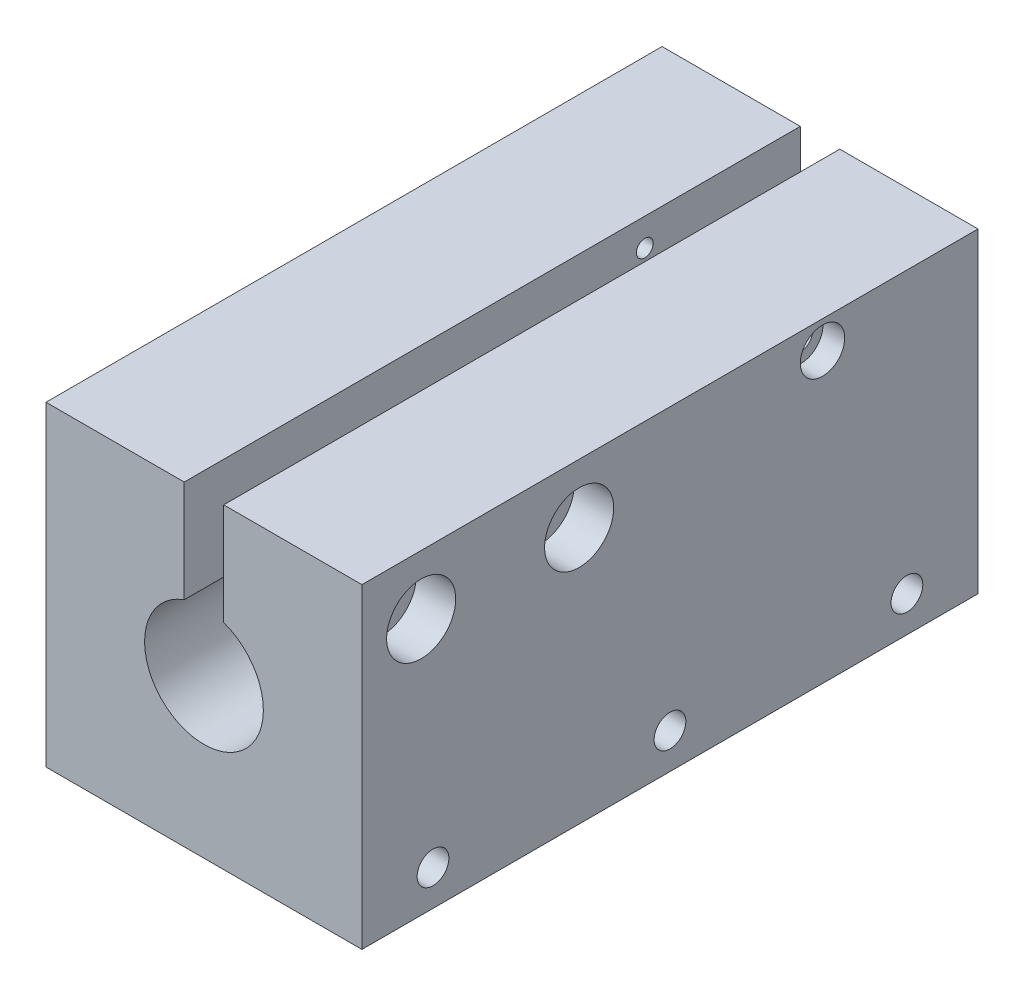
ISO-10303-21;
HEADER;
FILE_DESCRIPTION(('STEP AP214'),'2;1');
FILE_NAME('part.step','',(''),(''),'','','');
FILE_SCHEMA(('AUTOMOTIVE_DESIGN { 1 0 10303 214 1 1 1 1 }'));
ENDSEC;
DATA;
#1=APPLICATION_CONTEXT('core data for automotive mechanical design processes');
#2=APPLICATION_PROTOCOL_DEFINITION('international standard','automotive_design',2000,#1);
#3=PRODUCT_CONTEXT('',#1,'mechanical');
#4=PRODUCT('Part','Part','',(#3));
#5=PRODUCT_RELATED_PRODUCT_CATEGORY('part','',(#4));
#6=PRODUCT_DEFINITION_FORMATION('','',#4);
#7=PRODUCT_DEFINITION_CONTEXT('part definition',#1,'design');
#8=PRODUCT_DEFINITION('design','',#6,#7);
#9=PRODUCT_DEFINITION_SHAPE('','',#8);
#10=(LENGTH_UNIT() NAMED_UNIT(*) SI_UNIT(.MILLI.,.METRE.));
#11=(NAMED_UNIT(*) PLANE_ANGLE_UNIT() SI_UNIT($,.RADIAN.));
#12=(NAMED_UNIT(*) SI_UNIT($,.STERADIAN.) SOLID_ANGLE_UNIT());
#13=UNCERTAINTY_MEASURE_WITH_UNIT(LENGTH_MEASURE(1.E-05),#10,'distance_accuracy_value','');
#14=(GEOMETRIC_REPRESENTATION_CONTEXT(3) GLOBAL_UNCERTAINTY_ASSIGNED_CONTEXT((#13)) GLOBAL_UNIT_ASSIGNED_CONTEXT((#10,
#11,#12)) REPRESENTATION_CONTEXT('',''));
#15=CARTESIAN_POINT('',(0.,0.,0.));
#16=DIRECTION('',(0.,0.,1.));
#17=DIRECTION('',(1.,0.,0.));
#18=AXIS2_PLACEMENT_3D('',#15,#16,#17);
#19=CARTESIAN_POINT('',(0.,50.8,99.06));
#20=DIRECTION('',(0.,-1.,0.));
#21=DIRECTION('',(0.,0.,-1.));
#22=AXIS2_PLACEMENT_3D('',#19,#20,#21);
#23=PLANE('',#22);
#24=DIRECTION('',(-1.,0.,0.));
#25=VECTOR('',#24,1.);
#26=CARTESIAN_POINT('',(0.,50.8,0.));
#27=LINE('',#26,#25);
#28=CARTESIAN_POINT('',(50.8,50.8,0.));
#29=VERTEX_POINT('',#28);
#30=CARTESIAN_POINT('',(28.575,50.8,0.));
#31=VERTEX_POINT('',#30);
#32=EDGE_CURVE('E269',#29,#31,#27,.T.);
#33=ORIENTED_EDGE('',*,*,#32,.T.);
#34=DIRECTION('',(0.,0.,-1.));
#35=VECTOR('',#34,1.);
#36=CARTESIAN_POINT('',(28.575,50.8,99.06));
#37=LINE('',#36,#35);
#38=CARTESIAN_POINT('',(28.575,50.8,99.06));
#39=VERTEX_POINT('',#38);
#40=EDGE_CURVE('E239',#39,#31,#37,.T.);
#41=ORIENTED_EDGE('',*,*,#40,.F.);
#42=DIRECTION('',(-1.,0.,0.));
#43=VECTOR('',#42,1.);
#44=CARTESIAN_POINT('',(0.,50.8,99.06));
#45=LINE('',#44,#43);
#46=CARTESIAN_POINT('',(50.8,50.8,99.06));
#47=VERTEX_POINT('',#46);
#48=EDGE_CURVE('E274',#47,#39,#45,.T.);
#49=ORIENTED_EDGE('',*,*,#48,.F.);
#50=DIRECTION('',(0.,0.,-1.));
#51=VECTOR('',#50,1.);
#52=CARTESIAN_POINT('',(50.8,50.8,99.06));
#53=LINE('',#52,#51);
#54=EDGE_CURVE('E289',#47,#29,#53,.T.);
#55=ORIENTED_EDGE('',*,*,#54,.T.);
#56=EDGE_LOOP('',(#33,#41,#49,#55));
#57=FACE_BOUND('',#56,.T.);
#58=ADVANCED_FACE('F39',(#57),#23,.F.);
#59=CARTESIAN_POINT('',(0.,0.,99.06));
#60=DIRECTION('',(1.,0.,0.));
#61=DIRECTION('',(0.,1.,0.));
#62=AXIS2_PLACEMENT_3D('',#59,#60,#61);
#63=PLANE('',#62);
#64=CARTESIAN_POINT('',(0.,5.71499999999999,11.43));
#65=DIRECTION('',(-1.,0.,0.));
#66=DIRECTION('',(0.,0.,1.));
#67=AXIS2_PLACEMENT_3D('',#64,#65,#66);
#68=CIRCLE('',#67,2.55269999999999);
#69=CARTESIAN_POINT('',(0.,5.71499999999999,13.9827));
#70=VERTEX_POINT('',#69);
#71=EDGE_CURVE('E142',#70,#70,#68,.T.);
#72=ORIENTED_EDGE('',*,*,#71,.F.);
#73=EDGE_LOOP('',(#72));
#74=FACE_BOUND('',#73,.T.);
#75=CARTESIAN_POINT('',(0.,5.71499999999999,49.53));
#76=DIRECTION('',(-1.,0.,0.));
#77=DIRECTION('',(0.,0.,1.));
#78=AXIS2_PLACEMENT_3D('',#75,#76,#77);
#79=CIRCLE('',#78,2.55269999999999);
#80=CARTESIAN_POINT('',(0.,5.71499999999999,52.0827));
#81=VERTEX_POINT('',#80);
#82=EDGE_CURVE('E141',#81,#81,#79,.T.);
#83=ORIENTED_EDGE('',*,*,#82,.F.);
#84=EDGE_LOOP('',(#83));
#85=FACE_BOUND('',#84,.T.);
#86=CARTESIAN_POINT('',(0.,5.71499999999999,87.63));
#87=DIRECTION('',(-1.,0.,0.));
#88=DIRECTION('',(0.,0.,1.));
#89=AXIS2_PLACEMENT_3D('',#86,#87,#88);
#90=CIRCLE('',#89,2.55269999999999);
#91=CARTESIAN_POINT('',(0.,5.71499999999999,90.1827));
#92=VERTEX_POINT('',#91);
#93=EDGE_CURVE('E152',#92,#92,#90,.T.);
#94=ORIENTED_EDGE('',*,*,#93,.F.);
#95=EDGE_LOOP('',(#94));
#96=FACE_BOUND('',#95,.T.);
#97=CARTESIAN_POINT('',(0.,46.355,25.));
#98=DIRECTION('',(1.,0.,0.));
#99=DIRECTION('',(0.,0.,-1.));
#100=AXIS2_PLACEMENT_3D('',#97,#98,#99);
#101=CIRCLE('',#100,1.35254999999999);
#102=CARTESIAN_POINT('',(0.,46.355,23.64745));
#103=VERTEX_POINT('',#102);
#104=EDGE_CURVE('E179',#103,#103,#101,.T.);
#105=ORIENTED_EDGE('',*,*,#104,.T.);
#106=EDGE_LOOP('',(#105));
#107=FACE_BOUND('',#106,.T.);
#108=CARTESIAN_POINT('',(0.,41.275,89.535));
#109=DIRECTION('',(1.,0.,0.));
#110=DIRECTION('',(0.,1.,0.));
#111=AXIS2_PLACEMENT_3D('',#108,#109,#110);
#112=CIRCLE('',#111,2.55269999999999);
#113=CARTESIAN_POINT('',(0.,43.8277,89.535));
#114=VERTEX_POINT('',#113);
#115=EDGE_CURVE('E195',#114,#114,#112,.F.);
#116=ORIENTED_EDGE('',*,*,#115,.F.);
#117=EDGE_LOOP('',(#116));
#118=FACE_BOUND('',#117,.T.);
#119=CARTESIAN_POINT('',(0.,41.275,64.135));
#120=DIRECTION('',(1.,0.,0.));
#121=DIRECTION('',(0.,1.,0.));
#122=AXIS2_PLACEMENT_3D('',#119,#120,#121);
#123=CIRCLE('',#122,2.55269999999999);
#124=CARTESIAN_POINT('',(0.,43.8277,64.135));
#125=VERTEX_POINT('',#124);
#126=EDGE_CURVE('E201',#125,#125,#123,.F.);
#127=ORIENTED_EDGE('',*,*,#126,.F.);
#128=EDGE_LOOP('',(#127));
#129=FACE_BOUND('',#128,.T.);
#130=DIRECTION('',(0.,-1.,0.));
#131=VECTOR('',#130,1.);
#132=CARTESIAN_POINT('',(0.,0.,0.));
#133=LINE('',#132,#131);
#134=CARTESIAN_POINT('',(0.,50.8,0.));
#135=VERTEX_POINT('',#134);
#136=CARTESIAN_POINT('',(0.,0.,0.));
#137=VERTEX_POINT('',#136);
#138=EDGE_CURVE('E262',#135,#137,#133,.T.);
#139=ORIENTED_EDGE('',*,*,#138,.T.);
#140=DIRECTION('',(0.,0.,-1.));
#141=VECTOR('',#140,1.);
#142=CARTESIAN_POINT('',(0.,0.,99.06));
#143=LINE('',#142,#141);
#144=CARTESIAN_POINT('',(0.,0.,99.06));
#145=VERTEX_POINT('',#144);
#146=EDGE_CURVE('E295',#145,#137,#143,.T.);
#147=ORIENTED_EDGE('',*,*,#146,.F.);
#148=DIRECTION('',(0.,-1.,0.));
#149=VECTOR('',#148,1.);
#150=CARTESIAN_POINT('',(0.,0.,99.06));
#151=LINE('',#150,#149);
#152=CARTESIAN_POINT('',(0.,50.8,99.06));
#153=VERTEX_POINT('',#152);
#154=EDGE_CURVE('E265',#153,#145,#151,.T.);
#155=ORIENTED_EDGE('',*,*,#154,.F.);
#156=DIRECTION('',(0.,0.,-1.));
#157=VECTOR('',#156,1.);
#158=CARTESIAN_POINT('',(0.,50.8,99.06));
#159=LINE('',#158,#157);
#160=EDGE_CURVE('E277',#153,#135,#159,.T.);
#161=ORIENTED_EDGE('',*,*,#160,.T.);
#162=EDGE_LOOP('',(#139,#147,#155,#161));
#163=FACE_BOUND('',#162,.T.);
#164=ADVANCED_FACE('F41',(#74,#85,#96,#107,#118,#129,#163),#63,.F.);
#165=CARTESIAN_POINT('',(0.,0.,99.06));
#166=DIRECTION('',(0.,1.,0.));
#167=DIRECTION('',(0.,0.,1.));
#168=AXIS2_PLACEMENT_3D('',#165,#166,#167);
#169=PLANE('',#168);
#170=DIRECTION('',(1.,0.,0.));
#171=VECTOR('',#170,1.);
#172=CARTESIAN_POINT('',(0.,0.,0.));
#173=LINE('',#172,#171);
#174=CARTESIAN_POINT('',(50.8,0.,0.));
#175=VERTEX_POINT('',#174);
#176=EDGE_CURVE('E280',#137,#175,#173,.T.);
#177=ORIENTED_EDGE('',*,*,#176,.T.);
#178=DIRECTION('',(0.,0.,-1.));
#179=VECTOR('',#178,1.);
#180=CARTESIAN_POINT('',(50.8,0.,99.06));
#181=LINE('',#180,#179);
#182=CARTESIAN_POINT('',(50.8,0.,99.06));
#183=VERTEX_POINT('',#182);
#184=EDGE_CURVE('E292',#183,#175,#181,.T.);
#185=ORIENTED_EDGE('',*,*,#184,.F.);
#186=DIRECTION('',(1.,0.,0.));
#187=VECTOR('',#186,1.);
#188=CARTESIAN_POINT('',(0.,0.,99.06));
#189=LINE('',#188,#187);
#190=EDGE_CURVE('E268',#145,#183,#189,.T.);
#191=ORIENTED_EDGE('',*,*,#190,.F.);
#192=ORIENTED_EDGE('',*,*,#146,.T.);
#193=EDGE_LOOP('',(#177,#185,#191,#192));
#194=FACE_BOUND('',#193,.T.);
#195=ADVANCED_FACE('F334',(#194),#169,.F.);
#196=CARTESIAN_POINT('',(50.8,0.,99.06));
#197=DIRECTION('',(-1.,0.,0.));
#198=DIRECTION('',(0.,-1.,0.));
#199=AXIS2_PLACEMENT_3D('',#196,#197,#198);
#200=PLANE('',#199);
#201=CARTESIAN_POINT('',(50.8,5.715,87.63));
#202=DIRECTION('',(1.,0.,0.));
#203=DIRECTION('',(0.,0.,-1.));
#204=AXIS2_PLACEMENT_3D('',#201,#202,#203);
#205=CIRCLE('',#204,2.55269999999999);
#206=CARTESIAN_POINT('',(50.8,5.715,85.0773));
#207=VERTEX_POINT('',#206);
#208=EDGE_CURVE('E158',#207,#207,#205,.T.);
#209=ORIENTED_EDGE('',*,*,#208,.F.);
#210=EDGE_LOOP('',(#209));
#211=FACE_BOUND('',#210,.T.);
#212=CARTESIAN_POINT('',(50.8,5.715,49.53));
#213=DIRECTION('',(1.,0.,0.));
#214=DIRECTION('',(0.,0.,-1.));
#215=AXIS2_PLACEMENT_3D('',#212,#213,#214);
#216=CIRCLE('',#215,2.55269999999999);
#217=CARTESIAN_POINT('',(50.8,5.715,46.9773));
#218=VERTEX_POINT('',#217);
#219=EDGE_CURVE('E164',#218,#218,#216,.T.);
#220=ORIENTED_EDGE('',*,*,#219,.F.);
#221=EDGE_LOOP('',(#220));
#222=FACE_BOUND('',#221,.T.);
#223=CARTESIAN_POINT('',(50.8,5.715,11.43));
#224=DIRECTION('',(1.,0.,0.));
#225=DIRECTION('',(0.,0.,-1.));
#226=AXIS2_PLACEMENT_3D('',#223,#224,#225);
#227=CIRCLE('',#226,2.55269999999999);
#228=CARTESIAN_POINT('',(50.8,5.715,8.87730000000001));
#229=VERTEX_POINT('',#228);
#230=EDGE_CURVE('E170',#229,#229,#227,.T.);
#231=ORIENTED_EDGE('',*,*,#230,.F.);
#232=EDGE_LOOP('',(#231));
#233=FACE_BOUND('',#232,.T.);
#234=CARTESIAN_POINT('',(50.8,46.355,25.));
#235=DIRECTION('',(1.,0.,0.));
#236=DIRECTION('',(0.,0.,-1.));
#237=AXIS2_PLACEMENT_3D('',#234,#235,#236);
#238=CIRCLE('',#237,3.57251);
#239=CARTESIAN_POINT('',(50.8,46.355,21.42749));
#240=VERTEX_POINT('',#239);
#241=EDGE_CURVE('E182',#240,#240,#238,.T.);
#242=ORIENTED_EDGE('',*,*,#241,.F.);
#243=EDGE_LOOP('',(#242));
#244=FACE_BOUND('',#243,.T.);
#245=CARTESIAN_POINT('',(50.8,41.275,89.535));
#246=DIRECTION('',(1.,0.,0.));
#247=DIRECTION('',(0.,0.,-1.));
#248=AXIS2_PLACEMENT_3D('',#245,#246,#247);
#249=CIRCLE('',#248,5.55625);
#250=CARTESIAN_POINT('',(50.8,41.275,83.97875));
#251=VERTEX_POINT('',#250);
#252=EDGE_CURVE('E204',#251,#251,#249,.T.);
#253=ORIENTED_EDGE('',*,*,#252,.F.);
#254=EDGE_LOOP('',(#253));
#255=FACE_BOUND('',#254,.T.);
#256=CARTESIAN_POINT('',(50.8,41.275,64.135));
#257=DIRECTION('',(1.,0.,0.));
#258=DIRECTION('',(0.,0.,-1.));
#259=AXIS2_PLACEMENT_3D('',#256,#257,#258);
#260=CIRCLE('',#259,5.55625);
#261=CARTESIAN_POINT('',(50.8,41.275,58.57875));
#262=VERTEX_POINT('',#261);
#263=EDGE_CURVE('E210',#262,#262,#260,.T.);
#264=ORIENTED_EDGE('',*,*,#263,.F.);
#265=EDGE_LOOP('',(#264));
#266=FACE_BOUND('',#265,.T.);
#267=DIRECTION('',(0.,1.,0.));
#268=VECTOR('',#267,1.);
#269=CARTESIAN_POINT('',(50.8,0.,0.));
#270=LINE('',#269,#268);
#271=EDGE_CURVE('E282',#175,#29,#270,.T.);
#272=ORIENTED_EDGE('',*,*,#271,.T.);
#273=ORIENTED_EDGE('',*,*,#54,.F.);
#274=DIRECTION('',(0.,1.,0.));
#275=VECTOR('',#274,1.);
#276=CARTESIAN_POINT('',(50.8,0.,99.06));
#277=LINE('',#276,#275);
#278=EDGE_CURVE('E271',#183,#47,#277,.T.);
#279=ORIENTED_EDGE('',*,*,#278,.F.);
#280=ORIENTED_EDGE('',*,*,#184,.T.);
#281=EDGE_LOOP('',(#272,#273,#279,#280));
#282=FACE_BOUND('',#281,.T.);
#283=ADVANCED_FACE('F336',(#211,#222,#233,#244,#255,#266,#282),#200,.F.);
#284=CARTESIAN_POINT('',(22.225,50.8,99.06));
#285=VERTEX_POINT('',#284);
#286=EDGE_CURVE('E273',#285,#153,#45,.T.);
#287=ORIENTED_EDGE('',*,*,#286,.F.);
#288=DIRECTION('',(0.,0.,-1.));
#289=VECTOR('',#288,1.);
#290=CARTESIAN_POINT('',(22.225,50.8,99.06));
#291=LINE('',#290,#289);
#292=CARTESIAN_POINT('',(22.225,50.8,0.));
#293=VERTEX_POINT('',#292);
#294=EDGE_CURVE('E236',#285,#293,#291,.T.);
#295=ORIENTED_EDGE('',*,*,#294,.T.);
#296=EDGE_CURVE('E284',#293,#135,#27,.T.);
#297=ORIENTED_EDGE('',*,*,#296,.T.);
#298=ORIENTED_EDGE('',*,*,#160,.F.);
#299=EDGE_LOOP('',(#287,#295,#297,#298));
#300=FACE_BOUND('',#299,.T.);
#301=ADVANCED_FACE('F327',(#300),#23,.F.);
#302=CARTESIAN_POINT('',(0.,0.,99.06));
#303=DIRECTION('',(0.,0.,-1.));
#304=DIRECTION('',(-1.,0.,0.));
#305=AXIS2_PLACEMENT_3D('',#302,#303,#304);
#306=PLANE('',#305);
#307=ORIENTED_EDGE('',*,*,#48,.T.);
#308=DIRECTION('',(0.,-1.,0.));
#309=VECTOR('',#308,1.);
#310=CARTESIAN_POINT('',(28.575,50.8,99.06));
#311=LINE('',#310,#309);
#312=CARTESIAN_POINT('',(28.575,34.4071924127333,99.06));
#313=VERTEX_POINT('',#312);
#314=EDGE_CURVE('E231',#39,#313,#311,.T.);
#315=ORIENTED_EDGE('',*,*,#314,.T.);
#316=CARTESIAN_POINT('',(25.4,25.4,99.06));
#317=DIRECTION('',(0.,0.,-1.));
#318=DIRECTION('',(-1.,0.,0.));
#319=AXIS2_PLACEMENT_3D('',#316,#317,#318);
#320=CIRCLE('',#319,9.5504);
#321=CARTESIAN_POINT('',(22.225,34.4071924127333,99.06));
#322=VERTEX_POINT('',#321);
#323=EDGE_CURVE('E253',#313,#322,#320,.T.);
#324=ORIENTED_EDGE('',*,*,#323,.T.);
#325=DIRECTION('',(0.,1.,0.));
#326=VECTOR('',#325,1.);
#327=CARTESIAN_POINT('',(22.225,50.8,99.06));
#328=LINE('',#327,#326);
#329=EDGE_CURVE('E61',#322,#285,#328,.T.);
#330=ORIENTED_EDGE('',*,*,#329,.T.);
#331=ORIENTED_EDGE('',*,*,#286,.T.);
#332=ORIENTED_EDGE('',*,*,#154,.T.);
#333=ORIENTED_EDGE('',*,*,#190,.T.);
#334=ORIENTED_EDGE('',*,*,#278,.T.);
#335=EDGE_LOOP('',(#307,#315,#324,#330,#331,#332,#333,#334));
#336=FACE_BOUND('',#335,.T.);
#337=ADVANCED_FACE('F303',(#336),#306,.F.);
#338=CARTESIAN_POINT('',(0.,0.,0.));
#339=DIRECTION('',(0.,0.,-1.));
#340=DIRECTION('',(-1.,0.,0.));
#341=AXIS2_PLACEMENT_3D('',#338,#339,#340);
#342=PLANE('',#341);
#343=DIRECTION('',(0.,-1.,0.));
#344=VECTOR('',#343,1.);
#345=CARTESIAN_POINT('',(28.575,50.8,0.));
#346=LINE('',#345,#344);
#347=CARTESIAN_POINT('',(28.575,41.8463331779458,0.));
#348=VERTEX_POINT('',#347);
#349=EDGE_CURVE('E222',#31,#348,#346,.T.);
#350=ORIENTED_EDGE('',*,*,#349,.F.);
#351=ORIENTED_EDGE('',*,*,#32,.F.);
#352=ORIENTED_EDGE('',*,*,#271,.F.);
#353=ORIENTED_EDGE('',*,*,#176,.F.);
#354=ORIENTED_EDGE('',*,*,#138,.F.);
#355=ORIENTED_EDGE('',*,*,#296,.F.);
#356=DIRECTION('',(0.,1.,0.));
#357=VECTOR('',#356,1.);
#358=CARTESIAN_POINT('',(22.225,50.8,0.));
#359=LINE('',#358,#357);
#360=CARTESIAN_POINT('',(22.225,41.8463331779458,0.));
#361=VERTEX_POINT('',#360);
#362=EDGE_CURVE('E234',#361,#293,#359,.T.);
#363=ORIENTED_EDGE('',*,*,#362,.F.);
#364=CARTESIAN_POINT('',(25.4,25.4,0.));
#365=DIRECTION('',(0.,0.,-1.));
#366=DIRECTION('',(-1.,0.,0.));
#367=AXIS2_PLACEMENT_3D('',#364,#365,#366);
#368=CIRCLE('',#367,16.75);
#369=EDGE_CURVE('E256',#348,#361,#368,.T.);
#370=ORIENTED_EDGE('',*,*,#369,.F.);
#371=EDGE_LOOP('',(#350,#351,#352,#353,#354,#355,#363,#370));
#372=FACE_BOUND('',#371,.T.);
#373=ADVANCED_FACE('F314',(#372),#342,.T.);
#374=CARTESIAN_POINT('',(25.4,25.4,43.18));
#375=DIRECTION('',(0.,0.,-1.));
#376=DIRECTION('',(-1.,0.,0.));
#377=AXIS2_PLACEMENT_3D('',#374,#375,#376);
#378=CYLINDRICAL_SURFACE('',#377,16.75);
#379=CARTESIAN_POINT('',(25.4,25.4,43.18));
#380=DIRECTION('',(0.,0.,-1.));
#381=DIRECTION('',(-1.,0.,0.));
#382=AXIS2_PLACEMENT_3D('',#379,#380,#381);
#383=CIRCLE('',#382,16.75);
#384=CARTESIAN_POINT('',(28.575,41.8463331779458,43.18));
#385=VERTEX_POINT('',#384);
#386=CARTESIAN_POINT('',(22.225,41.8463331779458,43.18));
#387=VERTEX_POINT('',#386);
#388=EDGE_CURVE('E259',#385,#387,#383,.T.);
#389=ORIENTED_EDGE('',*,*,#388,.F.);
#390=DIRECTION('',(0.,0.,-1.));
#391=VECTOR('',#390,1.);
#392=CARTESIAN_POINT('',(28.575,41.8463331779458,43.18));
#393=LINE('',#392,#391);
#394=EDGE_CURVE('E249',#385,#348,#393,.T.);
#395=ORIENTED_EDGE('',*,*,#394,.T.);
#396=ORIENTED_EDGE('',*,*,#369,.T.);
#397=DIRECTION('',(0.,0.,-1.));
#398=VECTOR('',#397,1.);
#399=CARTESIAN_POINT('',(22.225,41.8463331779458,43.18));
#400=LINE('',#399,#398);
#401=EDGE_CURVE('E245',#361,#387,#400,.F.);
#402=ORIENTED_EDGE('',*,*,#401,.T.);
#403=EDGE_LOOP('',(#389,#395,#396,#402));
#404=FACE_BOUND('',#403,.T.);
#405=ADVANCED_FACE('F319',(#404),#378,.F.);
#406=CARTESIAN_POINT('',(25.4,25.4,43.18));
#407=DIRECTION('',(0.,0.,-1.));
#408=DIRECTION('',(-1.,0.,0.));
#409=AXIS2_PLACEMENT_3D('',#406,#407,#408);
#410=PLANE('',#409);
#411=DIRECTION('',(0.,-1.,0.));
#412=VECTOR('',#411,1.);
#413=CARTESIAN_POINT('',(28.575,25.4,43.18));
#414=LINE('',#413,#412);
#415=CARTESIAN_POINT('',(28.575,34.4071924127333,43.18));
#416=VERTEX_POINT('',#415);
#417=EDGE_CURVE('E54',#385,#416,#414,.T.);
#418=ORIENTED_EDGE('',*,*,#417,.F.);
#419=ORIENTED_EDGE('',*,*,#388,.T.);
#420=DIRECTION('',(0.,1.,0.));
#421=VECTOR('',#420,1.);
#422=CARTESIAN_POINT('',(22.225,25.4,43.18));
#423=LINE('',#422,#421);
#424=CARTESIAN_POINT('',(22.225,34.4071924127333,43.18));
#425=VERTEX_POINT('',#424);
#426=EDGE_CURVE('E241',#425,#387,#423,.T.);
#427=ORIENTED_EDGE('',*,*,#426,.F.);
#428=CARTESIAN_POINT('',(25.4,25.4,43.18));
#429=DIRECTION('',(0.,0.,-1.));
#430=DIRECTION('',(-1.,0.,0.));
#431=AXIS2_PLACEMENT_3D('',#428,#429,#430);
#432=CIRCLE('',#431,9.5504);
#433=EDGE_CURVE('E252',#416,#425,#432,.T.);
#434=ORIENTED_EDGE('',*,*,#433,.F.);
#435=EDGE_LOOP('',(#418,#419,#427,#434));
#436=FACE_BOUND('',#435,.T.);
#437=ADVANCED_FACE('F321',(#436),#410,.T.);
#438=CARTESIAN_POINT('',(25.4,25.4,99.06));
#439=DIRECTION('',(0.,0.,-1.));
#440=DIRECTION('',(-1.,0.,0.));
#441=AXIS2_PLACEMENT_3D('',#438,#439,#440);
#442=CYLINDRICAL_SURFACE('',#441,9.5504);
#443=ORIENTED_EDGE('',*,*,#323,.F.);
#444=DIRECTION('',(0.,0.,-1.));
#445=VECTOR('',#444,1.);
#446=CARTESIAN_POINT('',(28.575,34.4071924127333,99.06));
#447=LINE('',#446,#445);
#448=EDGE_CURVE('E11',#313,#416,#447,.T.);
#449=ORIENTED_EDGE('',*,*,#448,.T.);
#450=ORIENTED_EDGE('',*,*,#433,.T.);
#451=DIRECTION('',(0.,0.,-1.));
#452=VECTOR('',#451,1.);
#453=CARTESIAN_POINT('',(22.225,34.4071924127333,99.06));
#454=LINE('',#453,#452);
#455=EDGE_CURVE('E47',#425,#322,#454,.F.);
#456=ORIENTED_EDGE('',*,*,#455,.T.);
#457=EDGE_LOOP('',(#443,#449,#450,#456));
#458=FACE_BOUND('',#457,.T.);
#459=ADVANCED_FACE('F299',(#458),#442,.F.);
#460=CARTESIAN_POINT('',(22.225,50.8,99.06));
#461=DIRECTION('',(-1.,0.,0.));
#462=DIRECTION('',(0.,-1.,0.));
#463=AXIS2_PLACEMENT_3D('',#460,#461,#462);
#464=PLANE('',#463);
#465=CARTESIAN_POINT('',(22.225,46.355,25.));
#466=DIRECTION('',(1.,0.,0.));
#467=DIRECTION('',(0.,0.,-1.));
#468=AXIS2_PLACEMENT_3D('',#465,#466,#467);
#469=CIRCLE('',#468,1.35254999999999);
#470=CARTESIAN_POINT('',(22.225,46.355,23.64745));
#471=VERTEX_POINT('',#470);
#472=EDGE_CURVE('E176',#471,#471,#469,.T.);
#473=ORIENTED_EDGE('',*,*,#472,.F.);
#474=EDGE_LOOP('',(#473));
#475=FACE_BOUND('',#474,.T.);
#476=CARTESIAN_POINT('',(22.225,41.275,89.535));
#477=DIRECTION('',(1.,0.,0.));
#478=DIRECTION('',(0.,0.,-1.));
#479=AXIS2_PLACEMENT_3D('',#476,#477,#478);
#480=CIRCLE('',#479,2.55269999999999);
#481=CARTESIAN_POINT('',(22.225,41.275,86.9823));
#482=VERTEX_POINT('',#481);
#483=EDGE_CURVE('E186',#482,#482,#480,.T.);
#484=ORIENTED_EDGE('',*,*,#483,.F.);
#485=EDGE_LOOP('',(#484));
#486=FACE_BOUND('',#485,.T.);
#487=CARTESIAN_POINT('',(22.225,41.275,64.135));
#488=DIRECTION('',(1.,0.,0.));
#489=DIRECTION('',(0.,0.,-1.));
#490=AXIS2_PLACEMENT_3D('',#487,#488,#489);
#491=CIRCLE('',#490,2.55269999999999);
#492=CARTESIAN_POINT('',(22.225,41.275,61.5823));
#493=VERTEX_POINT('',#492);
#494=EDGE_CURVE('E198',#493,#493,#491,.T.);
#495=ORIENTED_EDGE('',*,*,#494,.F.);
#496=EDGE_LOOP('',(#495));
#497=FACE_BOUND('',#496,.T.);
#498=ORIENTED_EDGE('',*,*,#362,.T.);
#499=ORIENTED_EDGE('',*,*,#294,.F.);
#500=ORIENTED_EDGE('',*,*,#329,.F.);
#501=ORIENTED_EDGE('',*,*,#455,.F.);
#502=ORIENTED_EDGE('',*,*,#426,.T.);
#503=ORIENTED_EDGE('',*,*,#401,.F.);
#504=EDGE_LOOP('',(#498,#499,#500,#501,#502,#503));
#505=FACE_BOUND('',#504,.T.);
#506=ADVANCED_FACE('F322',(#475,#486,#497,#505),#464,.F.);
#507=CARTESIAN_POINT('',(28.575,50.8,99.06));
#508=DIRECTION('',(1.,0.,0.));
#509=DIRECTION('',(0.,0.,-1.));
#510=AXIS2_PLACEMENT_3D('',#507,#508,#509);
#511=PLANE('',#510);
#512=CARTESIAN_POINT('',(28.575,46.355,25.));
#513=DIRECTION('',(1.,0.,0.));
#514=DIRECTION('',(0.,0.,-1.));
#515=AXIS2_PLACEMENT_3D('',#512,#513,#514);
#516=CIRCLE('',#515,1.89864999999999);
#517=CARTESIAN_POINT('',(28.575,46.355,23.10135));
#518=VERTEX_POINT('',#517);
#519=EDGE_CURVE('E183',#518,#518,#516,.F.);
#520=ORIENTED_EDGE('',*,*,#519,.F.);
#521=EDGE_LOOP('',(#520));
#522=FACE_BOUND('',#521,.T.);
#523=CARTESIAN_POINT('',(28.575,41.275,89.535));
#524=DIRECTION('',(1.,0.,0.));
#525=DIRECTION('',(0.,0.,-1.));
#526=AXIS2_PLACEMENT_3D('',#523,#524,#525);
#527=CIRCLE('',#526,3.3782);
#528=CARTESIAN_POINT('',(28.575,41.275,86.1568));
#529=VERTEX_POINT('',#528);
#530=EDGE_CURVE('E207',#529,#529,#527,.F.);
#531=ORIENTED_EDGE('',*,*,#530,.F.);
#532=EDGE_LOOP('',(#531));
#533=FACE_BOUND('',#532,.T.);
#534=CARTESIAN_POINT('',(28.575,41.275,64.135));
#535=DIRECTION('',(1.,0.,0.));
#536=DIRECTION('',(0.,0.,-1.));
#537=AXIS2_PLACEMENT_3D('',#534,#535,#536);
#538=CIRCLE('',#537,3.3782);
#539=CARTESIAN_POINT('',(28.575,41.275,60.7568));
#540=VERTEX_POINT('',#539);
#541=EDGE_CURVE('E219',#540,#540,#538,.F.);
#542=ORIENTED_EDGE('',*,*,#541,.F.);
#543=EDGE_LOOP('',(#542));
#544=FACE_BOUND('',#543,.T.);
#545=ORIENTED_EDGE('',*,*,#417,.T.);
#546=ORIENTED_EDGE('',*,*,#448,.F.);
#547=ORIENTED_EDGE('',*,*,#314,.F.);
#548=ORIENTED_EDGE('',*,*,#40,.T.);
#549=ORIENTED_EDGE('',*,*,#349,.T.);
#550=ORIENTED_EDGE('',*,*,#394,.F.);
#551=EDGE_LOOP('',(#545,#546,#547,#548,#549,#550));
#552=FACE_BOUND('',#551,.T.);
#553=ADVANCED_FACE('F307',(#522,#533,#544,#552),#511,.F.);
#554=CARTESIAN_POINT('',(50.8,41.275,64.135));
#555=DIRECTION('',(1.,0.,0.));
#556=DIRECTION('',(0.,0.,-1.));
#557=AXIS2_PLACEMENT_3D('',#554,#555,#556);
#558=CYLINDRICAL_SURFACE('',#557,3.3782);
#559=ORIENTED_EDGE('',*,*,#541,.T.);
#560=EDGE_LOOP('',(#559));
#561=FACE_BOUND('',#560,.T.);
#562=CARTESIAN_POINT('',(44.45,41.275,64.135));
#563=DIRECTION('',(1.,0.,0.));
#564=DIRECTION('',(0.,0.,-1.));
#565=AXIS2_PLACEMENT_3D('',#562,#563,#564);
#566=CIRCLE('',#565,3.3782);
#567=CARTESIAN_POINT('',(44.45,41.275,60.7568));
#568=VERTEX_POINT('',#567);
#569=EDGE_CURVE('E223',#568,#568,#566,.T.);
#570=ORIENTED_EDGE('',*,*,#569,.T.);
#571=EDGE_LOOP('',(#570));
#572=FACE_BOUND('',#571,.T.);
#573=ADVANCED_FACE('F365',(#561,#572),#558,.F.);
#574=CARTESIAN_POINT('',(44.45,44.6532,64.135));
#575=DIRECTION('',(-1.,0.,0.));
#576=DIRECTION('',(0.,0.,1.));
#577=AXIS2_PLACEMENT_3D('',#574,#575,#576);
#578=PLANE('',#577);
#579=ORIENTED_EDGE('',*,*,#569,.F.);
#580=EDGE_LOOP('',(#579));
#581=FACE_BOUND('',#580,.T.);
#582=CARTESIAN_POINT('',(44.45,41.275,64.135));
#583=DIRECTION('',(1.,0.,0.));
#584=DIRECTION('',(0.,0.,-1.));
#585=AXIS2_PLACEMENT_3D('',#582,#583,#584);
#586=CIRCLE('',#585,5.55625);
#587=CARTESIAN_POINT('',(44.45,41.275,58.57875));
#588=VERTEX_POINT('',#587);
#589=EDGE_CURVE('E226',#588,#588,#586,.T.);
#590=ORIENTED_EDGE('',*,*,#589,.T.);
#591=EDGE_LOOP('',(#590));
#592=FACE_BOUND('',#591,.T.);
#593=ADVANCED_FACE('F372',(#581,#592),#578,.F.);
#594=CARTESIAN_POINT('',(50.8,41.275,64.135));
#595=DIRECTION('',(1.,0.,0.));
#596=DIRECTION('',(0.,0.,-1.));
#597=AXIS2_PLACEMENT_3D('',#594,#595,#596);
#598=CYLINDRICAL_SURFACE('',#597,5.55625);
#599=ORIENTED_EDGE('',*,*,#589,.F.);
#600=EDGE_LOOP('',(#599));
#601=FACE_BOUND('',#600,.T.);
#602=ORIENTED_EDGE('',*,*,#263,.T.);
#603=EDGE_LOOP('',(#602));
#604=FACE_BOUND('',#603,.T.);
#605=ADVANCED_FACE('F376',(#601,#604),#598,.F.);
#606=CARTESIAN_POINT('',(50.8,41.275,89.535));
#607=DIRECTION('',(1.,0.,0.));
#608=DIRECTION('',(0.,0.,-1.));
#609=AXIS2_PLACEMENT_3D('',#606,#607,#608);
#610=CYLINDRICAL_SURFACE('',#609,3.3782);
#611=ORIENTED_EDGE('',*,*,#530,.T.);
#612=EDGE_LOOP('',(#611));
#613=FACE_BOUND('',#612,.T.);
#614=CARTESIAN_POINT('',(44.45,41.275,89.535));
#615=DIRECTION('',(1.,0.,0.));
#616=DIRECTION('',(0.,0.,-1.));
#617=AXIS2_PLACEMENT_3D('',#614,#615,#616);
#618=CIRCLE('',#617,3.3782);
#619=CARTESIAN_POINT('',(44.45,41.275,86.1568));
#620=VERTEX_POINT('',#619);
#621=EDGE_CURVE('E211',#620,#620,#618,.T.);
#622=ORIENTED_EDGE('',*,*,#621,.T.);
#623=EDGE_LOOP('',(#622));
#624=FACE_BOUND('',#623,.T.);
#625=ADVANCED_FACE('F380',(#613,#624),#610,.F.);
#626=CARTESIAN_POINT('',(44.45,44.6532,89.535));
#627=DIRECTION('',(-1.,0.,0.));
#628=DIRECTION('',(0.,0.,1.));
#629=AXIS2_PLACEMENT_3D('',#626,#627,#628);
#630=PLANE('',#629);
#631=ORIENTED_EDGE('',*,*,#621,.F.);
#632=EDGE_LOOP('',(#631));
#633=FACE_BOUND('',#632,.T.);
#634=CARTESIAN_POINT('',(44.45,41.275,89.535));
#635=DIRECTION('',(1.,0.,0.));
#636=DIRECTION('',(0.,0.,-1.));
#637=AXIS2_PLACEMENT_3D('',#634,#635,#636);
#638=CIRCLE('',#637,5.55625);
#639=CARTESIAN_POINT('',(44.45,41.275,83.97875));
#640=VERTEX_POINT('',#639);
#641=EDGE_CURVE('E214',#640,#640,#638,.T.);
#642=ORIENTED_EDGE('',*,*,#641,.T.);
#643=EDGE_LOOP('',(#642));
#644=FACE_BOUND('',#643,.T.);
#645=ADVANCED_FACE('F384',(#633,#644),#630,.F.);
#646=CARTESIAN_POINT('',(50.8,41.275,89.535));
#647=DIRECTION('',(1.,0.,0.));
#648=DIRECTION('',(0.,0.,-1.));
#649=AXIS2_PLACEMENT_3D('',#646,#647,#648);
#650=CYLINDRICAL_SURFACE('',#649,5.55625);
#651=ORIENTED_EDGE('',*,*,#641,.F.);
#652=EDGE_LOOP('',(#651));
#653=FACE_BOUND('',#652,.T.);
#654=ORIENTED_EDGE('',*,*,#252,.T.);
#655=EDGE_LOOP('',(#654));
#656=FACE_BOUND('',#655,.T.);
#657=ADVANCED_FACE('F388',(#653,#656),#650,.F.);
#658=CARTESIAN_POINT('',(22.225,41.275,64.135));
#659=DIRECTION('',(1.,0.,0.));
#660=DIRECTION('',(0.,0.,-1.));
#661=AXIS2_PLACEMENT_3D('',#658,#659,#660);
#662=CYLINDRICAL_SURFACE('',#661,2.55269999999999);
#663=ORIENTED_EDGE('',*,*,#126,.T.);
#664=EDGE_LOOP('',(#663));
#665=FACE_BOUND('',#664,.T.);
#666=ORIENTED_EDGE('',*,*,#494,.T.);
#667=EDGE_LOOP('',(#666));
#668=FACE_BOUND('',#667,.T.);
#669=ADVANCED_FACE('F392',(#665,#668),#662,.F.);
#670=CARTESIAN_POINT('',(22.225,41.275,89.535));
#671=DIRECTION('',(1.,0.,0.));
#672=DIRECTION('',(0.,0.,-1.));
#673=AXIS2_PLACEMENT_3D('',#670,#671,#672);
#674=CYLINDRICAL_SURFACE('',#673,2.55269999999999);
#675=ORIENTED_EDGE('',*,*,#115,.T.);
#676=EDGE_LOOP('',(#675));
#677=FACE_BOUND('',#676,.T.);
#678=ORIENTED_EDGE('',*,*,#483,.T.);
#679=EDGE_LOOP('',(#678));
#680=FACE_BOUND('',#679,.T.);
#681=ADVANCED_FACE('F396',(#677,#680),#674,.F.);
#682=CARTESIAN_POINT('',(50.8,46.355,25.));
#683=DIRECTION('',(1.,0.,0.));
#684=DIRECTION('',(0.,0.,-1.));
#685=AXIS2_PLACEMENT_3D('',#682,#683,#684);
#686=CYLINDRICAL_SURFACE('',#685,1.89864999999999);
#687=ORIENTED_EDGE('',*,*,#519,.T.);
#688=EDGE_LOOP('',(#687));
#689=FACE_BOUND('',#688,.T.);
#690=CARTESIAN_POINT('',(47.2948,46.355,25.));
#691=DIRECTION('',(1.,0.,0.));
#692=DIRECTION('',(0.,0.,-1.));
#693=AXIS2_PLACEMENT_3D('',#690,#691,#692);
#694=CIRCLE('',#693,1.89864999999999);
#695=CARTESIAN_POINT('',(47.2948,46.355,23.10135));
#696=VERTEX_POINT('',#695);
#697=EDGE_CURVE('E187',#696,#696,#694,.T.);
#698=ORIENTED_EDGE('',*,*,#697,.T.);
#699=EDGE_LOOP('',(#698));
#700=FACE_BOUND('',#699,.T.);
#701=ADVANCED_FACE('F400',(#689,#700),#686,.F.);
#702=CARTESIAN_POINT('',(47.2948,48.25365,25.));
#703=DIRECTION('',(-1.,0.,0.));
#704=DIRECTION('',(0.,0.,1.));
#705=AXIS2_PLACEMENT_3D('',#702,#703,#704);
#706=PLANE('',#705);
#707=ORIENTED_EDGE('',*,*,#697,.F.);
#708=EDGE_LOOP('',(#707));
#709=FACE_BOUND('',#708,.T.);
#710=CARTESIAN_POINT('',(47.2948,46.355,25.));
#711=DIRECTION('',(1.,0.,0.));
#712=DIRECTION('',(0.,0.,-1.));
#713=AXIS2_PLACEMENT_3D('',#710,#711,#712);
#714=CIRCLE('',#713,3.57251);
#715=CARTESIAN_POINT('',(47.2948,46.355,21.42749));
#716=VERTEX_POINT('',#715);
#717=EDGE_CURVE('E190',#716,#716,#714,.T.);
#718=ORIENTED_EDGE('',*,*,#717,.T.);
#719=EDGE_LOOP('',(#718));
#720=FACE_BOUND('',#719,.T.);
#721=ADVANCED_FACE('F404',(#709,#720),#706,.F.);
#722=CARTESIAN_POINT('',(50.8,46.355,25.));
#723=DIRECTION('',(1.,0.,0.));
#724=DIRECTION('',(0.,0.,-1.));
#725=AXIS2_PLACEMENT_3D('',#722,#723,#724);
#726=CYLINDRICAL_SURFACE('',#725,3.57251);
#727=ORIENTED_EDGE('',*,*,#717,.F.);
#728=EDGE_LOOP('',(#727));
#729=FACE_BOUND('',#728,.T.);
#730=ORIENTED_EDGE('',*,*,#241,.T.);
#731=EDGE_LOOP('',(#730));
#732=FACE_BOUND('',#731,.T.);
#733=ADVANCED_FACE('F408',(#729,#732),#726,.F.);
#734=CARTESIAN_POINT('',(22.225,46.355,25.));
#735=DIRECTION('',(1.,0.,0.));
#736=DIRECTION('',(0.,0.,-1.));
#737=AXIS2_PLACEMENT_3D('',#734,#735,#736);
#738=CYLINDRICAL_SURFACE('',#737,1.35254999999999);
#739=ORIENTED_EDGE('',*,*,#104,.F.);
#740=EDGE_LOOP('',(#739));
#741=FACE_BOUND('',#740,.T.);
#742=ORIENTED_EDGE('',*,*,#472,.T.);
#743=EDGE_LOOP('',(#742));
#744=FACE_BOUND('',#743,.T.);
#745=ADVANCED_FACE('F412',(#741,#744),#738,.F.);
#746=CARTESIAN_POINT('',(34.29,5.715,11.43));
#747=DIRECTION('',(1.,0.,0.));
#748=DIRECTION('',(0.,0.,-1.));
#749=AXIS2_PLACEMENT_3D('',#746,#747,#748);
#750=CONICAL_SURFACE('',#749,2.5527,1.02974425867665);
#751=CARTESIAN_POINT('',(32.7561830978083,5.715,11.43));
#752=VERTEX_POINT('',#751);
#753=VERTEX_LOOP('',#752);
#754=FACE_BOUND('',#753,.T.);
#755=CARTESIAN_POINT('',(34.29,5.715,11.43));
#756=DIRECTION('',(1.,0.,0.));
#757=DIRECTION('',(0.,0.,-1.));
#758=AXIS2_PLACEMENT_3D('',#755,#756,#757);
#759=CIRCLE('',#758,2.5527);
#760=CARTESIAN_POINT('',(34.29,5.715,8.8773));
#761=VERTEX_POINT('',#760);
#762=EDGE_CURVE('E173',#761,#761,#759,.T.);
#763=ORIENTED_EDGE('',*,*,#762,.T.);
#764=EDGE_LOOP('',(#763));
#765=FACE_BOUND('',#764,.T.);
#766=ADVANCED_FACE('F416',(#754,#765),#750,.F.);
#767=CARTESIAN_POINT('',(50.8,5.715,11.43));
#768=DIRECTION('',(1.,0.,0.));
#769=DIRECTION('',(0.,0.,-1.));
#770=AXIS2_PLACEMENT_3D('',#767,#768,#769);
#771=CYLINDRICAL_SURFACE('',#770,2.55269999999999);
#772=ORIENTED_EDGE('',*,*,#762,.F.);
#773=EDGE_LOOP('',(#772));
#774=FACE_BOUND('',#773,.T.);
#775=ORIENTED_EDGE('',*,*,#230,.T.);
#776=EDGE_LOOP('',(#775));
#777=FACE_BOUND('',#776,.T.);
#778=ADVANCED_FACE('F420',(#774,#777),#771,.F.);
#779=CARTESIAN_POINT('',(34.29,5.715,49.53));
#780=DIRECTION('',(1.,0.,0.));
#781=DIRECTION('',(0.,0.,-1.));
#782=AXIS2_PLACEMENT_3D('',#779,#780,#781);
#783=CONICAL_SURFACE('',#782,2.5527,1.02974425867665);
#784=CARTESIAN_POINT('',(32.7561830978083,5.715,49.53));
#785=VERTEX_POINT('',#784);
#786=VERTEX_LOOP('',#785);
#787=FACE_BOUND('',#786,.T.);
#788=CARTESIAN_POINT('',(34.29,5.715,49.53));
#789=DIRECTION('',(1.,0.,0.));
#790=DIRECTION('',(0.,0.,-1.));
#791=AXIS2_PLACEMENT_3D('',#788,#789,#790);
#792=CIRCLE('',#791,2.5527);
#793=CARTESIAN_POINT('',(34.29,5.715,46.9773));
#794=VERTEX_POINT('',#793);
#795=EDGE_CURVE('E167',#794,#794,#792,.T.);
#796=ORIENTED_EDGE('',*,*,#795,.T.);
#797=EDGE_LOOP('',(#796));
#798=FACE_BOUND('',#797,.T.);
#799=ADVANCED_FACE('F424',(#787,#798),#783,.F.);
#800=CARTESIAN_POINT('',(50.8,5.715,49.53));
#801=DIRECTION('',(1.,0.,0.));
#802=DIRECTION('',(0.,0.,-1.));
#803=AXIS2_PLACEMENT_3D('',#800,#801,#802);
#804=CYLINDRICAL_SURFACE('',#803,2.55269999999999);
#805=ORIENTED_EDGE('',*,*,#795,.F.);
#806=EDGE_LOOP('',(#805));
#807=FACE_BOUND('',#806,.T.);
#808=ORIENTED_EDGE('',*,*,#219,.T.);
#809=EDGE_LOOP('',(#808));
#810=FACE_BOUND('',#809,.T.);
#811=ADVANCED_FACE('F428',(#807,#810),#804,.F.);
#812=CARTESIAN_POINT('',(34.29,5.715,87.63));
#813=DIRECTION('',(1.,0.,0.));
#814=DIRECTION('',(0.,0.,-1.));
#815=AXIS2_PLACEMENT_3D('',#812,#813,#814);
#816=CONICAL_SURFACE('',#815,2.5527,1.02974425867665);
#817=CARTESIAN_POINT('',(32.7561830978083,5.715,87.63));
#818=VERTEX_POINT('',#817);
#819=VERTEX_LOOP('',#818);
#820=FACE_BOUND('',#819,.T.);
#821=CARTESIAN_POINT('',(34.29,5.715,87.63));
#822=DIRECTION('',(1.,0.,0.));
#823=DIRECTION('',(0.,0.,-1.));
#824=AXIS2_PLACEMENT_3D('',#821,#822,#823);
#825=CIRCLE('',#824,2.5527);
#826=CARTESIAN_POINT('',(34.29,5.715,85.0773));
#827=VERTEX_POINT('',#826);
#828=EDGE_CURVE('E161',#827,#827,#825,.T.);
#829=ORIENTED_EDGE('',*,*,#828,.T.);
#830=EDGE_LOOP('',(#829));
#831=FACE_BOUND('',#830,.T.);
#832=ADVANCED_FACE('F432',(#820,#831),#816,.F.);
#833=CARTESIAN_POINT('',(50.8,5.715,87.63));
#834=DIRECTION('',(1.,0.,0.));
#835=DIRECTION('',(0.,0.,-1.));
#836=AXIS2_PLACEMENT_3D('',#833,#834,#835);
#837=CYLINDRICAL_SURFACE('',#836,2.55269999999999);
#838=ORIENTED_EDGE('',*,*,#828,.F.);
#839=EDGE_LOOP('',(#838));
#840=FACE_BOUND('',#839,.T.);
#841=ORIENTED_EDGE('',*,*,#208,.T.);
#842=EDGE_LOOP('',(#841));
#843=FACE_BOUND('',#842,.T.);
#844=ADVANCED_FACE('F436',(#840,#843),#837,.F.);
#845=CARTESIAN_POINT('',(16.51,5.71499999999999,87.63));
#846=DIRECTION('',(-1.,0.,0.));
#847=DIRECTION('',(0.,0.,1.));
#848=AXIS2_PLACEMENT_3D('',#845,#846,#847);
#849=CONICAL_SURFACE('',#848,2.55269999999999,1.02974425867665);
#850=CARTESIAN_POINT('',(18.0438169021916,5.71499999999999,87.63));
#851=VERTEX_POINT('',#850);
#852=VERTEX_LOOP('',#851);
#853=FACE_BOUND('',#852,.T.);
#854=CARTESIAN_POINT('',(16.51,5.71499999999999,87.63));
#855=DIRECTION('',(-1.,0.,0.));
#856=DIRECTION('',(0.,0.,1.));
#857=AXIS2_PLACEMENT_3D('',#854,#855,#856);
#858=CIRCLE('',#857,2.55269999999999);
#859=CARTESIAN_POINT('',(16.51,5.71499999999999,90.1827));
#860=VERTEX_POINT('',#859);
#861=EDGE_CURVE('E155',#860,#860,#858,.T.);
#862=ORIENTED_EDGE('',*,*,#861,.T.);
#863=EDGE_LOOP('',(#862));
#864=FACE_BOUND('',#863,.T.);
#865=ADVANCED_FACE('F440',(#853,#864),#849,.F.);
#866=CARTESIAN_POINT('',(0.,5.71499999999999,87.63));
#867=DIRECTION('',(-1.,0.,0.));
#868=DIRECTION('',(0.,0.,1.));
#869=AXIS2_PLACEMENT_3D('',#866,#867,#868);
#870=CYLINDRICAL_SURFACE('',#869,2.55269999999999);
#871=ORIENTED_EDGE('',*,*,#861,.F.);
#872=EDGE_LOOP('',(#871));
#873=FACE_BOUND('',#872,.T.);
#874=ORIENTED_EDGE('',*,*,#93,.T.);
#875=EDGE_LOOP('',(#874));
#876=FACE_BOUND('',#875,.T.);
#877=ADVANCED_FACE('F444',(#873,#876),#870,.F.);
#878=CARTESIAN_POINT('',(16.51,5.71499999999999,49.53));
#879=DIRECTION('',(-1.,0.,0.));
#880=DIRECTION('',(0.,0.,1.));
#881=AXIS2_PLACEMENT_3D('',#878,#879,#880);
#882=CONICAL_SURFACE('',#881,2.55269999999999,1.02974425867665);
#883=CARTESIAN_POINT('',(18.0438169021916,5.71499999999999,49.53));
#884=VERTEX_POINT('',#883);
#885=VERTEX_LOOP('',#884);
#886=FACE_BOUND('',#885,.T.);
#887=CARTESIAN_POINT('',(16.51,5.71499999999999,49.53));
#888=DIRECTION('',(-1.,0.,0.));
#889=DIRECTION('',(0.,0.,1.));
#890=AXIS2_PLACEMENT_3D('',#887,#888,#889);
#891=CIRCLE('',#890,2.55269999999999);
#892=CARTESIAN_POINT('',(16.51,5.71499999999999,52.0827));
#893=VERTEX_POINT('',#892);
#894=EDGE_CURVE('E145',#893,#893,#891,.T.);
#895=ORIENTED_EDGE('',*,*,#894,.T.);
#896=EDGE_LOOP('',(#895));
#897=FACE_BOUND('',#896,.T.);
#898=ADVANCED_FACE('F448',(#886,#897),#882,.F.);
#899=CARTESIAN_POINT('',(0.,5.71499999999999,49.53));
#900=DIRECTION('',(-1.,0.,0.));
#901=DIRECTION('',(0.,0.,1.));
#902=AXIS2_PLACEMENT_3D('',#899,#900,#901);
#903=CYLINDRICAL_SURFACE('',#902,2.55269999999999);
#904=ORIENTED_EDGE('',*,*,#894,.F.);
#905=EDGE_LOOP('',(#904));
#906=FACE_BOUND('',#905,.T.);
#907=ORIENTED_EDGE('',*,*,#82,.T.);
#908=EDGE_LOOP('',(#907));
#909=FACE_BOUND('',#908,.T.);
#910=ADVANCED_FACE('F135',(#906,#909),#903,.F.);
#911=CARTESIAN_POINT('',(16.51,5.71499999999999,11.43));
#912=DIRECTION('',(-1.,0.,0.));
#913=DIRECTION('',(0.,0.,1.));
#914=AXIS2_PLACEMENT_3D('',#911,#912,#913);
#915=CONICAL_SURFACE('',#914,2.55269999999999,1.02974425867665);
#916=CARTESIAN_POINT('',(18.0438169021916,5.71499999999999,11.43));
#917=VERTEX_POINT('',#916);
#918=VERTEX_LOOP('',#917);
#919=FACE_BOUND('',#918,.T.);
#920=CARTESIAN_POINT('',(16.51,5.71499999999999,11.43));
#921=DIRECTION('',(-1.,0.,0.));
#922=DIRECTION('',(0.,0.,1.));
#923=AXIS2_PLACEMENT_3D('',#920,#921,#922);
#924=CIRCLE('',#923,2.55269999999999);
#925=CARTESIAN_POINT('',(16.51,5.71499999999999,13.9827));
#926=VERTEX_POINT('',#925);
#927=EDGE_CURVE('E139',#926,#926,#924,.T.);
#928=ORIENTED_EDGE('',*,*,#927,.T.);
#929=EDGE_LOOP('',(#928));
#930=FACE_BOUND('',#929,.T.);
#931=ADVANCED_FACE('F131',(#919,#930),#915,.F.);
#932=CARTESIAN_POINT('',(0.,5.71499999999999,11.43));
#933=DIRECTION('',(-1.,0.,0.));
#934=DIRECTION('',(0.,0.,1.));
#935=AXIS2_PLACEMENT_3D('',#932,#933,#934);
#936=CYLINDRICAL_SURFACE('',#935,2.55269999999999);
#937=ORIENTED_EDGE('',*,*,#927,.F.);
#938=EDGE_LOOP('',(#937));
#939=FACE_BOUND('',#938,.T.);
#940=ORIENTED_EDGE('',*,*,#71,.T.);
#941=EDGE_LOOP('',(#940));
#942=FACE_BOUND('',#941,.T.);
#943=ADVANCED_FACE('F134',(#939,#942),#936,.F.);
#944=CLOSED_SHELL('',(#58,#164,#195,#283,#301,#337,#373,#405,#437,#459,#506,#553,#573,#593,#605,
#625,#645,#657,#669,#681,#701,#721,#733,#745,#766,#778,#799,#811,#832,#844,#865,#877,#898,#910,
#931,#943));
#945=MANIFOLD_SOLID_BREP('B2',#944);
#946=ADVANCED_BREP_SHAPE_REPRESENTATION('',(#18,#945),#14);
#947=SHAPE_DEFINITION_REPRESENTATION(#9,#946);
ENDSEC;
END-ISO-10303-21;
